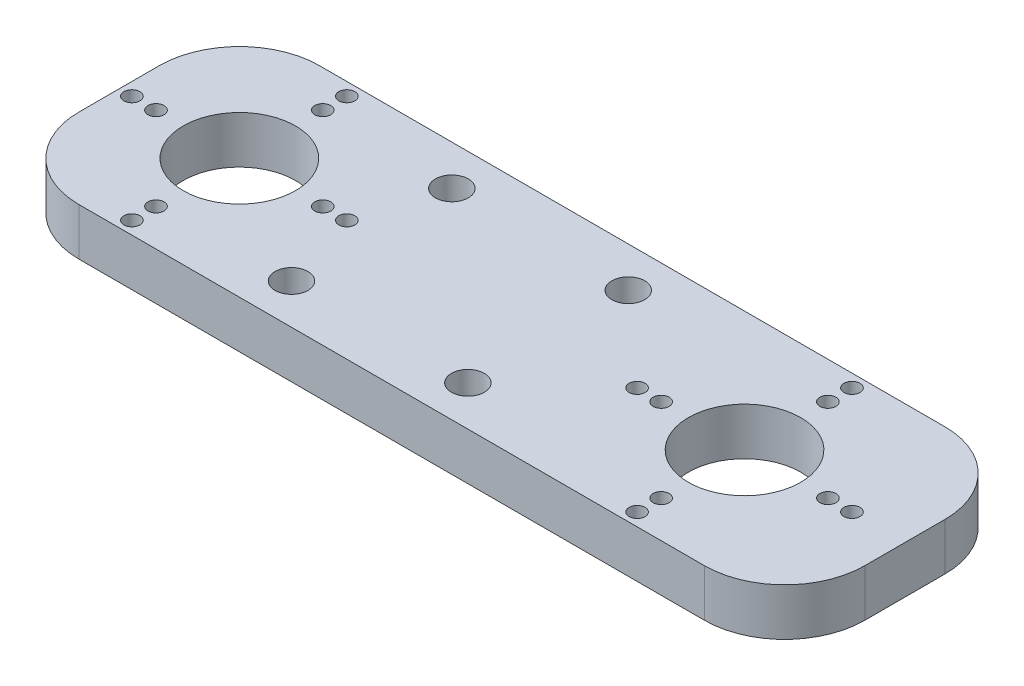
ISO-10303-21;
HEADER;
FILE_DESCRIPTION(('STEP AP214'),'2;1');
FILE_NAME('part.step','',(''),(''),'','','');
FILE_SCHEMA(('AUTOMOTIVE_DESIGN { 1 0 10303 214 1 1 1 1 }'));
ENDSEC;
DATA;
#1=APPLICATION_CONTEXT('core data for automotive mechanical design processes');
#2=APPLICATION_PROTOCOL_DEFINITION('international standard','automotive_design',2000,#1);
#3=PRODUCT_CONTEXT('',#1,'mechanical');
#4=PRODUCT('Part','Part','',(#3));
#5=PRODUCT_RELATED_PRODUCT_CATEGORY('part','',(#4));
#6=PRODUCT_DEFINITION_FORMATION('','',#4);
#7=PRODUCT_DEFINITION_CONTEXT('part definition',#1,'design');
#8=PRODUCT_DEFINITION('design','',#6,#7);
#9=PRODUCT_DEFINITION_SHAPE('','',#8);
#10=(LENGTH_UNIT() NAMED_UNIT(*) SI_UNIT(.MILLI.,.METRE.));
#11=(NAMED_UNIT(*) PLANE_ANGLE_UNIT() SI_UNIT($,.RADIAN.));
#12=(NAMED_UNIT(*) SI_UNIT($,.STERADIAN.) SOLID_ANGLE_UNIT());
#13=UNCERTAINTY_MEASURE_WITH_UNIT(LENGTH_MEASURE(1.E-05),#10,'distance_accuracy_value','');
#14=(GEOMETRIC_REPRESENTATION_CONTEXT(3) GLOBAL_UNCERTAINTY_ASSIGNED_CONTEXT((#13)) GLOBAL_UNIT_ASSIGNED_CONTEXT((#10,
#11,#12)) REPRESENTATION_CONTEXT('',''));
#15=CARTESIAN_POINT('',(0.,0.,0.));
#16=DIRECTION('',(0.,0.,1.));
#17=DIRECTION('',(1.,0.,0.));
#18=AXIS2_PLACEMENT_3D('',#15,#16,#17);
#19=CARTESIAN_POINT('',(0.,5.9,0.));
#20=DIRECTION('',(0.,-1.,0.));
#21=DIRECTION('',(0.,0.,-1.));
#22=AXIS2_PLACEMENT_3D('',#19,#20,#21);
#23=PLANE('',#22);
#24=CARTESIAN_POINT('',(-17.5,5.9,-10.));
#25=DIRECTION('',(0.,1.,0.));
#26=DIRECTION('',(0.,0.,1.));
#27=AXIS2_PLACEMENT_3D('',#24,#25,#26);
#28=CIRCLE('',#27,2.05);
#29=CARTESIAN_POINT('',(-17.5,5.9,-7.95));
#30=VERTEX_POINT('',#29);
#31=EDGE_CURVE('E680',#30,#30,#28,.T.);
#32=ORIENTED_EDGE('',*,*,#31,.F.);
#33=EDGE_LOOP('',(#32));
#34=FACE_BOUND('',#33,.T.);
#35=CARTESIAN_POINT('',(4.49999999999999,5.9,10.));
#36=DIRECTION('',(0.,1.,0.));
#37=DIRECTION('',(0.,0.,-1.));
#38=AXIS2_PLACEMENT_3D('',#35,#36,#37);
#39=CIRCLE('',#38,2.05);
#40=CARTESIAN_POINT('',(4.49999999999999,5.9,7.95));
#41=VERTEX_POINT('',#40);
#42=EDGE_CURVE('E681',#41,#41,#39,.T.);
#43=ORIENTED_EDGE('',*,*,#42,.F.);
#44=EDGE_LOOP('',(#43));
#45=FACE_BOUND('',#44,.T.);
#46=CARTESIAN_POINT('',(4.5,5.9,-10.));
#47=DIRECTION('',(0.,1.,0.));
#48=DIRECTION('',(0.,0.,-1.));
#49=AXIS2_PLACEMENT_3D('',#46,#47,#48);
#50=CIRCLE('',#49,2.05);
#51=CARTESIAN_POINT('',(4.5,5.9,-12.05));
#52=VERTEX_POINT('',#51);
#53=EDGE_CURVE('E685',#52,#52,#50,.T.);
#54=ORIENTED_EDGE('',*,*,#53,.F.);
#55=EDGE_LOOP('',(#54));
#56=FACE_BOUND('',#55,.T.);
#57=CARTESIAN_POINT('',(-17.5,5.9,10.));
#58=DIRECTION('',(0.,1.,0.));
#59=DIRECTION('',(0.,0.,1.));
#60=AXIS2_PLACEMENT_3D('',#57,#58,#59);
#61=CIRCLE('',#60,2.05);
#62=CARTESIAN_POINT('',(-17.5,5.9,12.05));
#63=VERTEX_POINT('',#62);
#64=EDGE_CURVE('E201',#63,#63,#61,.T.);
#65=ORIENTED_EDGE('',*,*,#64,.F.);
#66=EDGE_LOOP('',(#65));
#67=FACE_BOUND('',#66,.T.);
#68=CARTESIAN_POINT('',(29.,5.9,10.4));
#69=DIRECTION('',(0.,1.,0.));
#70=DIRECTION('',(0.,0.,-1.));
#71=AXIS2_PLACEMENT_3D('',#68,#69,#70);
#72=CIRCLE('',#71,0.999999999999991);
#73=CARTESIAN_POINT('',(29.,5.9,9.40000000000002));
#74=VERTEX_POINT('',#73);
#75=EDGE_CURVE('E231',#74,#74,#72,.T.);
#76=ORIENTED_EDGE('',*,*,#75,.F.);
#77=EDGE_LOOP('',(#76));
#78=FACE_BOUND('',#77,.T.);
#79=CARTESIAN_POINT('',(42.4,5.9,0.));
#80=DIRECTION('',(0.,1.,0.));
#81=DIRECTION('',(0.,0.,-1.));
#82=AXIS2_PLACEMENT_3D('',#79,#80,#81);
#83=CIRCLE('',#82,0.999999999999998);
#84=CARTESIAN_POINT('',(42.4,5.9,-1.00000000000001));
#85=VERTEX_POINT('',#84);
#86=EDGE_CURVE('E234',#85,#85,#83,.T.);
#87=ORIENTED_EDGE('',*,*,#86,.F.);
#88=EDGE_LOOP('',(#87));
#89=FACE_BOUND('',#88,.T.);
#90=CARTESIAN_POINT('',(39.4,5.9,0.));
#91=DIRECTION('',(0.,1.,0.));
#92=DIRECTION('',(0.,0.,-1.));
#93=AXIS2_PLACEMENT_3D('',#90,#91,#92);
#94=CIRCLE('',#93,0.999999999999998);
#95=CARTESIAN_POINT('',(39.4,5.9,-1.00000000000001));
#96=VERTEX_POINT('',#95);
#97=EDGE_CURVE('E228',#96,#96,#94,.T.);
#98=ORIENTED_EDGE('',*,*,#97,.F.);
#99=EDGE_LOOP('',(#98));
#100=FACE_BOUND('',#99,.T.);
#101=CARTESIAN_POINT('',(18.6,5.9,0.));
#102=DIRECTION('',(0.,1.,0.));
#103=DIRECTION('',(0.,0.,-1.));
#104=AXIS2_PLACEMENT_3D('',#101,#102,#103);
#105=CIRCLE('',#104,0.999999999999998);
#106=CARTESIAN_POINT('',(18.6,5.9,-0.999999999999997));
#107=VERTEX_POINT('',#106);
#108=EDGE_CURVE('E212',#107,#107,#105,.T.);
#109=ORIENTED_EDGE('',*,*,#108,.F.);
#110=EDGE_LOOP('',(#109));
#111=FACE_BOUND('',#110,.T.);
#112=CARTESIAN_POINT('',(29.,5.9,-13.4));
#113=DIRECTION('',(0.,1.,0.));
#114=DIRECTION('',(0.,0.,-1.));
#115=AXIS2_PLACEMENT_3D('',#112,#113,#114);
#116=CIRCLE('',#115,0.999999999999998);
#117=CARTESIAN_POINT('',(29.,5.9,-14.4));
#118=VERTEX_POINT('',#117);
#119=EDGE_CURVE('E217',#118,#118,#116,.T.);
#120=ORIENTED_EDGE('',*,*,#119,.F.);
#121=EDGE_LOOP('',(#120));
#122=FACE_BOUND('',#121,.T.);
#123=CARTESIAN_POINT('',(29.,5.9,-10.4));
#124=DIRECTION('',(0.,1.,0.));
#125=DIRECTION('',(0.,0.,-1.));
#126=AXIS2_PLACEMENT_3D('',#123,#124,#125);
#127=CIRCLE('',#126,0.999999999999998);
#128=CARTESIAN_POINT('',(29.,5.9,-11.4));
#129=VERTEX_POINT('',#128);
#130=EDGE_CURVE('E223',#129,#129,#127,.T.);
#131=ORIENTED_EDGE('',*,*,#130,.F.);
#132=EDGE_LOOP('',(#131));
#133=FACE_BOUND('',#132,.T.);
#134=CARTESIAN_POINT('',(29.,5.9,0.));
#135=DIRECTION('',(0.,1.,0.));
#136=DIRECTION('',(0.,0.,-1.));
#137=AXIS2_PLACEMENT_3D('',#134,#135,#136);
#138=CIRCLE('',#137,7.);
#139=CARTESIAN_POINT('',(29.,5.9,-7.));
#140=VERTEX_POINT('',#139);
#141=EDGE_CURVE('E225',#140,#140,#138,.T.);
#142=ORIENTED_EDGE('',*,*,#141,.F.);
#143=EDGE_LOOP('',(#142));
#144=FACE_BOUND('',#143,.T.);
#145=CARTESIAN_POINT('',(29.,5.9,13.4));
#146=DIRECTION('',(0.,1.,0.));
#147=DIRECTION('',(0.,0.,-1.));
#148=AXIS2_PLACEMENT_3D('',#145,#146,#147);
#149=CIRCLE('',#148,0.999999999999991);
#150=CARTESIAN_POINT('',(29.,5.9,12.4));
#151=VERTEX_POINT('',#150);
#152=EDGE_CURVE('E150',#151,#151,#149,.T.);
#153=ORIENTED_EDGE('',*,*,#152,.F.);
#154=EDGE_LOOP('',(#153));
#155=FACE_BOUND('',#154,.T.);
#156=CARTESIAN_POINT('',(15.6,5.9,0.));
#157=DIRECTION('',(0.,1.,0.));
#158=DIRECTION('',(0.,0.,-1.));
#159=AXIS2_PLACEMENT_3D('',#156,#157,#158);
#160=CIRCLE('',#159,0.999999999999998);
#161=CARTESIAN_POINT('',(15.6,5.9,-0.999999999999996));
#162=VERTEX_POINT('',#161);
#163=EDGE_CURVE('E208',#162,#162,#160,.T.);
#164=ORIENTED_EDGE('',*,*,#163,.F.);
#165=EDGE_LOOP('',(#164));
#166=FACE_BOUND('',#165,.T.);
#167=DIRECTION('',(1.,0.,0.));
#168=VECTOR('',#167,1.);
#169=CARTESIAN_POINT('',(-49.,5.9,15.));
#170=LINE('',#169,#168);
#171=CARTESIAN_POINT('',(-39.,5.9,15.));
#172=VERTEX_POINT('',#171);
#173=CARTESIAN_POINT('',(39.,5.9,15.));
#174=VERTEX_POINT('',#173);
#175=EDGE_CURVE('E140',#172,#174,#170,.T.);
#176=ORIENTED_EDGE('',*,*,#175,.T.);
#177=CARTESIAN_POINT('',(39.,5.9,5.));
#178=DIRECTION('',(0.,-1.,0.));
#179=DIRECTION('',(0.,0.,-1.));
#180=AXIS2_PLACEMENT_3D('',#177,#178,#179);
#181=CIRCLE('',#180,10.);
#182=CARTESIAN_POINT('',(49.,5.9,5.));
#183=VERTEX_POINT('',#182);
#184=EDGE_CURVE('E188',#174,#183,#181,.F.);
#185=ORIENTED_EDGE('',*,*,#184,.T.);
#186=DIRECTION('',(0.,0.,-1.));
#187=VECTOR('',#186,1.);
#188=CARTESIAN_POINT('',(49.,5.9,15.));
#189=LINE('',#188,#187);
#190=CARTESIAN_POINT('',(49.,5.9,-5.));
#191=VERTEX_POINT('',#190);
#192=EDGE_CURVE('E123',#183,#191,#189,.T.);
#193=ORIENTED_EDGE('',*,*,#192,.T.);
#194=CARTESIAN_POINT('',(39.,5.9,-5.));
#195=DIRECTION('',(0.,-1.,0.));
#196=DIRECTION('',(0.,0.,-1.));
#197=AXIS2_PLACEMENT_3D('',#194,#195,#196);
#198=CIRCLE('',#197,10.);
#199=CARTESIAN_POINT('',(39.,5.9,-15.));
#200=VERTEX_POINT('',#199);
#201=EDGE_CURVE('E186',#191,#200,#198,.F.);
#202=ORIENTED_EDGE('',*,*,#201,.T.);
#203=DIRECTION('',(-1.,0.,0.));
#204=VECTOR('',#203,1.);
#205=CARTESIAN_POINT('',(-49.,5.9,-15.));
#206=LINE('',#205,#204);
#207=CARTESIAN_POINT('',(-39.,5.9,-15.));
#208=VERTEX_POINT('',#207);
#209=EDGE_CURVE('E291',#200,#208,#206,.T.);
#210=ORIENTED_EDGE('',*,*,#209,.T.);
#211=CARTESIAN_POINT('',(-39.,5.9,-5.));
#212=DIRECTION('',(0.,-1.,0.));
#213=DIRECTION('',(0.,0.,-1.));
#214=AXIS2_PLACEMENT_3D('',#211,#212,#213);
#215=CIRCLE('',#214,10.);
#216=CARTESIAN_POINT('',(-49.,5.9,-5.));
#217=VERTEX_POINT('',#216);
#218=EDGE_CURVE('E58',#208,#217,#215,.F.);
#219=ORIENTED_EDGE('',*,*,#218,.T.);
#220=DIRECTION('',(0.,0.,1.));
#221=VECTOR('',#220,1.);
#222=CARTESIAN_POINT('',(-49.,5.9,15.));
#223=LINE('',#222,#221);
#224=CARTESIAN_POINT('',(-49.,5.9,5.));
#225=VERTEX_POINT('',#224);
#226=EDGE_CURVE('E292',#217,#225,#223,.T.);
#227=ORIENTED_EDGE('',*,*,#226,.T.);
#228=CARTESIAN_POINT('',(-39.,5.9,5.));
#229=DIRECTION('',(0.,-1.,0.));
#230=DIRECTION('',(0.,0.,-1.));
#231=AXIS2_PLACEMENT_3D('',#228,#229,#230);
#232=CIRCLE('',#231,10.);
#233=EDGE_CURVE('E184',#225,#172,#232,.F.);
#234=ORIENTED_EDGE('',*,*,#233,.T.);
#235=EDGE_LOOP('',(#176,#185,#193,#202,#210,#219,#227,#234));
#236=FACE_BOUND('',#235,.T.);
#237=CARTESIAN_POINT('',(-44.4,5.9,0.));
#238=DIRECTION('',(0.,1.,0.));
#239=DIRECTION('',(0.,0.,1.));
#240=AXIS2_PLACEMENT_3D('',#237,#238,#239);
#241=CIRCLE('',#240,0.999999999999998);
#242=CARTESIAN_POINT('',(-44.4,5.9,0.999999999999998));
#243=VERTEX_POINT('',#242);
#244=EDGE_CURVE('E131',#243,#243,#241,.T.);
#245=ORIENTED_EDGE('',*,*,#244,.F.);
#246=EDGE_LOOP('',(#245));
#247=FACE_BOUND('',#246,.T.);
#248=CARTESIAN_POINT('',(-47.4,5.9,0.));
#249=DIRECTION('',(0.,1.,0.));
#250=DIRECTION('',(0.,0.,1.));
#251=AXIS2_PLACEMENT_3D('',#248,#249,#250);
#252=CIRCLE('',#251,0.999999999999998);
#253=CARTESIAN_POINT('',(-47.4,5.9,0.999999999999998));
#254=VERTEX_POINT('',#253);
#255=EDGE_CURVE('E283',#254,#254,#252,.T.);
#256=ORIENTED_EDGE('',*,*,#255,.F.);
#257=EDGE_LOOP('',(#256));
#258=FACE_BOUND('',#257,.T.);
#259=CARTESIAN_POINT('',(-34.,5.9,-10.4));
#260=DIRECTION('',(0.,1.,0.));
#261=DIRECTION('',(0.,0.,1.));
#262=AXIS2_PLACEMENT_3D('',#259,#260,#261);
#263=CIRCLE('',#262,0.999999999999998);
#264=CARTESIAN_POINT('',(-34.,5.9,-9.40000000000001));
#265=VERTEX_POINT('',#264);
#266=EDGE_CURVE('E277',#265,#265,#263,.T.);
#267=ORIENTED_EDGE('',*,*,#266,.F.);
#268=EDGE_LOOP('',(#267));
#269=FACE_BOUND('',#268,.T.);
#270=CARTESIAN_POINT('',(-34.,5.9,0.));
#271=DIRECTION('',(0.,1.,0.));
#272=DIRECTION('',(0.,0.,1.));
#273=AXIS2_PLACEMENT_3D('',#270,#271,#272);
#274=CIRCLE('',#273,7.);
#275=CARTESIAN_POINT('',(-34.,5.9,7.));
#276=VERTEX_POINT('',#275);
#277=EDGE_CURVE('E271',#276,#276,#274,.T.);
#278=ORIENTED_EDGE('',*,*,#277,.F.);
#279=EDGE_LOOP('',(#278));
#280=FACE_BOUND('',#279,.T.);
#281=CARTESIAN_POINT('',(-34.,5.9,-13.4));
#282=DIRECTION('',(0.,1.,0.));
#283=DIRECTION('',(0.,0.,1.));
#284=AXIS2_PLACEMENT_3D('',#281,#282,#283);
#285=CIRCLE('',#284,0.999999999999998);
#286=CARTESIAN_POINT('',(-34.,5.9,-12.4));
#287=VERTEX_POINT('',#286);
#288=EDGE_CURVE('E265',#287,#287,#285,.T.);
#289=ORIENTED_EDGE('',*,*,#288,.F.);
#290=EDGE_LOOP('',(#289));
#291=FACE_BOUND('',#290,.T.);
#292=CARTESIAN_POINT('',(-23.6,5.9,0.));
#293=DIRECTION('',(0.,1.,0.));
#294=DIRECTION('',(0.,0.,1.));
#295=AXIS2_PLACEMENT_3D('',#292,#293,#294);
#296=CIRCLE('',#295,0.999999999999998);
#297=CARTESIAN_POINT('',(-23.6,5.9,1.));
#298=VERTEX_POINT('',#297);
#299=EDGE_CURVE('E259',#298,#298,#296,.T.);
#300=ORIENTED_EDGE('',*,*,#299,.F.);
#301=EDGE_LOOP('',(#300));
#302=FACE_BOUND('',#301,.T.);
#303=CARTESIAN_POINT('',(-20.6,5.9,0.));
#304=DIRECTION('',(0.,1.,0.));
#305=DIRECTION('',(0.,0.,1.));
#306=AXIS2_PLACEMENT_3D('',#303,#304,#305);
#307=CIRCLE('',#306,0.999999999999998);
#308=CARTESIAN_POINT('',(-20.6,5.9,1.));
#309=VERTEX_POINT('',#308);
#310=EDGE_CURVE('E253',#309,#309,#307,.T.);
#311=ORIENTED_EDGE('',*,*,#310,.F.);
#312=EDGE_LOOP('',(#311));
#313=FACE_BOUND('',#312,.T.);
#314=CARTESIAN_POINT('',(-34.,5.9,10.4));
#315=DIRECTION('',(0.,1.,0.));
#316=DIRECTION('',(0.,0.,1.));
#317=AXIS2_PLACEMENT_3D('',#314,#315,#316);
#318=CIRCLE('',#317,0.999999999999991);
#319=CARTESIAN_POINT('',(-34.,5.9,11.4));
#320=VERTEX_POINT('',#319);
#321=EDGE_CURVE('E247',#320,#320,#318,.T.);
#322=ORIENTED_EDGE('',*,*,#321,.F.);
#323=EDGE_LOOP('',(#322));
#324=FACE_BOUND('',#323,.T.);
#325=CARTESIAN_POINT('',(-34.,5.9,13.4));
#326=DIRECTION('',(0.,1.,0.));
#327=DIRECTION('',(0.,0.,1.));
#328=AXIS2_PLACEMENT_3D('',#325,#326,#327);
#329=CIRCLE('',#328,0.999999999999991);
#330=CARTESIAN_POINT('',(-34.,5.9,14.4));
#331=VERTEX_POINT('',#330);
#332=EDGE_CURVE('E241',#331,#331,#329,.T.);
#333=ORIENTED_EDGE('',*,*,#332,.F.);
#334=EDGE_LOOP('',(#333));
#335=FACE_BOUND('',#334,.T.);
#336=ADVANCED_FACE('F36',(#34,#45,#56,#67,#78,#89,#100,#111,#122,#133,#144,#155,#166,#236,#247,
#258,#269,#280,#291,#302,#313,#324,#335),#23,.F.);
#337=CARTESIAN_POINT('',(0.,0.,0.));
#338=DIRECTION('',(0.,-1.,0.));
#339=DIRECTION('',(0.,0.,-1.));
#340=AXIS2_PLACEMENT_3D('',#337,#338,#339);
#341=PLANE('',#340);
#342=CARTESIAN_POINT('',(-17.5,0.,-10.));
#343=DIRECTION('',(0.,-1.,0.));
#344=DIRECTION('',(0.,0.,-1.));
#345=AXIS2_PLACEMENT_3D('',#342,#343,#344);
#346=CIRCLE('',#345,2.05);
#347=CARTESIAN_POINT('',(-17.5,0.,-12.05));
#348=VERTEX_POINT('',#347);
#349=EDGE_CURVE('E40',#348,#348,#346,.T.);
#350=ORIENTED_EDGE('',*,*,#349,.F.);
#351=EDGE_LOOP('',(#350));
#352=FACE_BOUND('',#351,.T.);
#353=CARTESIAN_POINT('',(4.49999999999999,0.,10.));
#354=DIRECTION('',(0.,-1.,0.));
#355=DIRECTION('',(0.,0.,-1.));
#356=AXIS2_PLACEMENT_3D('',#353,#354,#355);
#357=CIRCLE('',#356,2.05);
#358=CARTESIAN_POINT('',(4.49999999999999,0.,7.95));
#359=VERTEX_POINT('',#358);
#360=EDGE_CURVE('E203',#359,#359,#357,.T.);
#361=ORIENTED_EDGE('',*,*,#360,.F.);
#362=EDGE_LOOP('',(#361));
#363=FACE_BOUND('',#362,.T.);
#364=CARTESIAN_POINT('',(4.5,0.,-10.));
#365=DIRECTION('',(0.,-1.,0.));
#366=DIRECTION('',(0.,0.,-1.));
#367=AXIS2_PLACEMENT_3D('',#364,#365,#366);
#368=CIRCLE('',#367,2.05);
#369=CARTESIAN_POINT('',(4.5,0.,-12.05));
#370=VERTEX_POINT('',#369);
#371=EDGE_CURVE('E200',#370,#370,#368,.T.);
#372=ORIENTED_EDGE('',*,*,#371,.F.);
#373=EDGE_LOOP('',(#372));
#374=FACE_BOUND('',#373,.T.);
#375=CARTESIAN_POINT('',(-17.5,0.,10.));
#376=DIRECTION('',(0.,-1.,0.));
#377=DIRECTION('',(0.,0.,-1.));
#378=AXIS2_PLACEMENT_3D('',#375,#376,#377);
#379=CIRCLE('',#378,2.05);
#380=CARTESIAN_POINT('',(-17.5,0.,7.95));
#381=VERTEX_POINT('',#380);
#382=EDGE_CURVE('E197',#381,#381,#379,.T.);
#383=ORIENTED_EDGE('',*,*,#382,.F.);
#384=EDGE_LOOP('',(#383));
#385=FACE_BOUND('',#384,.T.);
#386=CARTESIAN_POINT('',(29.,0.,10.4));
#387=DIRECTION('',(0.,-1.,0.));
#388=DIRECTION('',(0.,0.,-1.));
#389=AXIS2_PLACEMENT_3D('',#386,#387,#388);
#390=CIRCLE('',#389,0.999999999999991);
#391=CARTESIAN_POINT('',(29.,0.,9.40000000000002));
#392=VERTEX_POINT('',#391);
#393=EDGE_CURVE('E171',#392,#392,#390,.T.);
#394=ORIENTED_EDGE('',*,*,#393,.F.);
#395=EDGE_LOOP('',(#394));
#396=FACE_BOUND('',#395,.T.);
#397=CARTESIAN_POINT('',(42.4,0.,0.));
#398=DIRECTION('',(0.,-1.,0.));
#399=DIRECTION('',(0.,0.,-1.));
#400=AXIS2_PLACEMENT_3D('',#397,#398,#399);
#401=CIRCLE('',#400,0.999999999999998);
#402=CARTESIAN_POINT('',(42.4,0.,-1.00000000000001));
#403=VERTEX_POINT('',#402);
#404=EDGE_CURVE('E168',#403,#403,#401,.T.);
#405=ORIENTED_EDGE('',*,*,#404,.F.);
#406=EDGE_LOOP('',(#405));
#407=FACE_BOUND('',#406,.T.);
#408=CARTESIAN_POINT('',(39.4,0.,0.));
#409=DIRECTION('',(0.,-1.,0.));
#410=DIRECTION('',(0.,0.,-1.));
#411=AXIS2_PLACEMENT_3D('',#408,#409,#410);
#412=CIRCLE('',#411,0.999999999999998);
#413=CARTESIAN_POINT('',(39.4,0.,-1.00000000000001));
#414=VERTEX_POINT('',#413);
#415=EDGE_CURVE('E165',#414,#414,#412,.T.);
#416=ORIENTED_EDGE('',*,*,#415,.F.);
#417=EDGE_LOOP('',(#416));
#418=FACE_BOUND('',#417,.T.);
#419=CARTESIAN_POINT('',(18.6,0.,0.));
#420=DIRECTION('',(0.,-1.,0.));
#421=DIRECTION('',(0.,0.,-1.));
#422=AXIS2_PLACEMENT_3D('',#419,#420,#421);
#423=CIRCLE('',#422,0.999999999999998);
#424=CARTESIAN_POINT('',(18.6,0.,-0.999999999999997));
#425=VERTEX_POINT('',#424);
#426=EDGE_CURVE('E162',#425,#425,#423,.T.);
#427=ORIENTED_EDGE('',*,*,#426,.F.);
#428=EDGE_LOOP('',(#427));
#429=FACE_BOUND('',#428,.T.);
#430=CARTESIAN_POINT('',(29.,0.,-13.4));
#431=DIRECTION('',(0.,-1.,0.));
#432=DIRECTION('',(0.,0.,-1.));
#433=AXIS2_PLACEMENT_3D('',#430,#431,#432);
#434=CIRCLE('',#433,0.999999999999998);
#435=CARTESIAN_POINT('',(29.,0.,-14.4));
#436=VERTEX_POINT('',#435);
#437=EDGE_CURVE('E159',#436,#436,#434,.T.);
#438=ORIENTED_EDGE('',*,*,#437,.F.);
#439=EDGE_LOOP('',(#438));
#440=FACE_BOUND('',#439,.T.);
#441=CARTESIAN_POINT('',(29.,0.,-10.4));
#442=DIRECTION('',(0.,-1.,0.));
#443=DIRECTION('',(0.,0.,-1.));
#444=AXIS2_PLACEMENT_3D('',#441,#442,#443);
#445=CIRCLE('',#444,0.999999999999998);
#446=CARTESIAN_POINT('',(29.,0.,-11.4));
#447=VERTEX_POINT('',#446);
#448=EDGE_CURVE('E156',#447,#447,#445,.T.);
#449=ORIENTED_EDGE('',*,*,#448,.F.);
#450=EDGE_LOOP('',(#449));
#451=FACE_BOUND('',#450,.T.);
#452=CARTESIAN_POINT('',(29.,0.,0.));
#453=DIRECTION('',(0.,-1.,0.));
#454=DIRECTION('',(0.,0.,-1.));
#455=AXIS2_PLACEMENT_3D('',#452,#453,#454);
#456=CIRCLE('',#455,7.);
#457=CARTESIAN_POINT('',(29.,0.,-7.));
#458=VERTEX_POINT('',#457);
#459=EDGE_CURVE('E153',#458,#458,#456,.T.);
#460=ORIENTED_EDGE('',*,*,#459,.F.);
#461=EDGE_LOOP('',(#460));
#462=FACE_BOUND('',#461,.T.);
#463=CARTESIAN_POINT('',(29.,0.,13.4));
#464=DIRECTION('',(0.,-1.,0.));
#465=DIRECTION('',(0.,0.,-1.));
#466=AXIS2_PLACEMENT_3D('',#463,#464,#465);
#467=CIRCLE('',#466,0.999999999999991);
#468=CARTESIAN_POINT('',(29.,0.,12.4));
#469=VERTEX_POINT('',#468);
#470=EDGE_CURVE('E149',#469,#469,#467,.T.);
#471=ORIENTED_EDGE('',*,*,#470,.F.);
#472=EDGE_LOOP('',(#471));
#473=FACE_BOUND('',#472,.T.);
#474=CARTESIAN_POINT('',(15.6,0.,0.));
#475=DIRECTION('',(0.,-1.,0.));
#476=DIRECTION('',(0.,0.,-1.));
#477=AXIS2_PLACEMENT_3D('',#474,#475,#476);
#478=CIRCLE('',#477,0.999999999999998);
#479=CARTESIAN_POINT('',(15.6,0.,-0.999999999999996));
#480=VERTEX_POINT('',#479);
#481=EDGE_CURVE('E146',#480,#480,#478,.T.);
#482=ORIENTED_EDGE('',*,*,#481,.F.);
#483=EDGE_LOOP('',(#482));
#484=FACE_BOUND('',#483,.T.);
#485=CARTESIAN_POINT('',(-34.,0.,10.4));
#486=DIRECTION('',(0.,1.,0.));
#487=DIRECTION('',(0.,0.,1.));
#488=AXIS2_PLACEMENT_3D('',#485,#486,#487);
#489=CIRCLE('',#488,0.999999999999991);
#490=CARTESIAN_POINT('',(-34.,0.,11.4));
#491=VERTEX_POINT('',#490);
#492=EDGE_CURVE('E244',#491,#491,#489,.T.);
#493=ORIENTED_EDGE('',*,*,#492,.T.);
#494=EDGE_LOOP('',(#493));
#495=FACE_BOUND('',#494,.T.);
#496=CARTESIAN_POINT('',(-23.6,0.,0.));
#497=DIRECTION('',(0.,1.,0.));
#498=DIRECTION('',(0.,0.,1.));
#499=AXIS2_PLACEMENT_3D('',#496,#497,#498);
#500=CIRCLE('',#499,0.999999999999998);
#501=CARTESIAN_POINT('',(-23.6,0.,1.));
#502=VERTEX_POINT('',#501);
#503=EDGE_CURVE('E256',#502,#502,#500,.T.);
#504=ORIENTED_EDGE('',*,*,#503,.T.);
#505=EDGE_LOOP('',(#504));
#506=FACE_BOUND('',#505,.T.);
#507=CARTESIAN_POINT('',(-34.,0.,0.));
#508=DIRECTION('',(0.,1.,0.));
#509=DIRECTION('',(0.,0.,1.));
#510=AXIS2_PLACEMENT_3D('',#507,#508,#509);
#511=CIRCLE('',#510,7.);
#512=CARTESIAN_POINT('',(-34.,0.,7.));
#513=VERTEX_POINT('',#512);
#514=EDGE_CURVE('E268',#513,#513,#511,.T.);
#515=ORIENTED_EDGE('',*,*,#514,.T.);
#516=EDGE_LOOP('',(#515));
#517=FACE_BOUND('',#516,.T.);
#518=CARTESIAN_POINT('',(-47.4,0.,0.));
#519=DIRECTION('',(0.,1.,0.));
#520=DIRECTION('',(0.,0.,1.));
#521=AXIS2_PLACEMENT_3D('',#518,#519,#520);
#522=CIRCLE('',#521,0.999999999999998);
#523=CARTESIAN_POINT('',(-47.4,0.,0.999999999999998));
#524=VERTEX_POINT('',#523);
#525=EDGE_CURVE('E280',#524,#524,#522,.T.);
#526=ORIENTED_EDGE('',*,*,#525,.T.);
#527=EDGE_LOOP('',(#526));
#528=FACE_BOUND('',#527,.T.);
#529=DIRECTION('',(0.,0.,-1.));
#530=VECTOR('',#529,1.);
#531=CARTESIAN_POINT('',(49.,0.,15.));
#532=LINE('',#531,#530);
#533=CARTESIAN_POINT('',(49.,0.,5.));
#534=VERTEX_POINT('',#533);
#535=CARTESIAN_POINT('',(49.,0.,-5.));
#536=VERTEX_POINT('',#535);
#537=EDGE_CURVE('E120',#534,#536,#532,.T.);
#538=ORIENTED_EDGE('',*,*,#537,.F.);
#539=CARTESIAN_POINT('',(39.,0.,5.));
#540=DIRECTION('',(0.,-1.,0.));
#541=DIRECTION('',(0.,0.,-1.));
#542=AXIS2_PLACEMENT_3D('',#539,#540,#541);
#543=CIRCLE('',#542,10.);
#544=CARTESIAN_POINT('',(39.,0.,15.));
#545=VERTEX_POINT('',#544);
#546=EDGE_CURVE('E103',#534,#545,#543,.T.);
#547=ORIENTED_EDGE('',*,*,#546,.T.);
#548=DIRECTION('',(1.,0.,0.));
#549=VECTOR('',#548,1.);
#550=CARTESIAN_POINT('',(-49.,0.,15.));
#551=LINE('',#550,#549);
#552=CARTESIAN_POINT('',(-39.,0.,15.));
#553=VERTEX_POINT('',#552);
#554=EDGE_CURVE('E144',#553,#545,#551,.T.);
#555=ORIENTED_EDGE('',*,*,#554,.F.);
#556=CARTESIAN_POINT('',(-39.,0.,5.));
#557=DIRECTION('',(0.,-1.,0.));
#558=DIRECTION('',(0.,0.,-1.));
#559=AXIS2_PLACEMENT_3D('',#556,#557,#558);
#560=CIRCLE('',#559,10.);
#561=CARTESIAN_POINT('',(-49.,0.,5.));
#562=VERTEX_POINT('',#561);
#563=EDGE_CURVE('E177',#553,#562,#560,.T.);
#564=ORIENTED_EDGE('',*,*,#563,.T.);
#565=DIRECTION('',(0.,0.,1.));
#566=VECTOR('',#565,1.);
#567=CARTESIAN_POINT('',(-49.,0.,15.));
#568=LINE('',#567,#566);
#569=CARTESIAN_POINT('',(-49.,0.,-5.));
#570=VERTEX_POINT('',#569);
#571=EDGE_CURVE('E134',#570,#562,#568,.T.);
#572=ORIENTED_EDGE('',*,*,#571,.F.);
#573=CARTESIAN_POINT('',(-39.,0.,-5.));
#574=DIRECTION('',(0.,-1.,0.));
#575=DIRECTION('',(0.,0.,-1.));
#576=AXIS2_PLACEMENT_3D('',#573,#574,#575);
#577=CIRCLE('',#576,10.);
#578=CARTESIAN_POINT('',(-39.,0.,-15.));
#579=VERTEX_POINT('',#578);
#580=EDGE_CURVE('E124',#570,#579,#577,.T.);
#581=ORIENTED_EDGE('',*,*,#580,.T.);
#582=DIRECTION('',(-1.,0.,0.));
#583=VECTOR('',#582,1.);
#584=CARTESIAN_POINT('',(-49.,0.,-15.));
#585=LINE('',#584,#583);
#586=CARTESIAN_POINT('',(39.,0.,-15.));
#587=VERTEX_POINT('',#586);
#588=EDGE_CURVE('E130',#587,#579,#585,.T.);
#589=ORIENTED_EDGE('',*,*,#588,.F.);
#590=CARTESIAN_POINT('',(39.,0.,-5.));
#591=DIRECTION('',(0.,-1.,0.));
#592=DIRECTION('',(0.,0.,-1.));
#593=AXIS2_PLACEMENT_3D('',#590,#591,#592);
#594=CIRCLE('',#593,10.);
#595=EDGE_CURVE('E114',#587,#536,#594,.T.);
#596=ORIENTED_EDGE('',*,*,#595,.T.);
#597=EDGE_LOOP('',(#538,#547,#555,#564,#572,#581,#589,#596));
#598=FACE_BOUND('',#597,.T.);
#599=CARTESIAN_POINT('',(-44.4,0.,0.));
#600=DIRECTION('',(0.,1.,0.));
#601=DIRECTION('',(0.,0.,1.));
#602=AXIS2_PLACEMENT_3D('',#599,#600,#601);
#603=CIRCLE('',#602,0.999999999999998);
#604=CARTESIAN_POINT('',(-44.4,0.,0.999999999999998));
#605=VERTEX_POINT('',#604);
#606=EDGE_CURVE('E137',#605,#605,#603,.T.);
#607=ORIENTED_EDGE('',*,*,#606,.T.);
#608=EDGE_LOOP('',(#607));
#609=FACE_BOUND('',#608,.T.);
#610=CARTESIAN_POINT('',(-34.,0.,-10.4));
#611=DIRECTION('',(0.,1.,0.));
#612=DIRECTION('',(0.,0.,1.));
#613=AXIS2_PLACEMENT_3D('',#610,#611,#612);
#614=CIRCLE('',#613,0.999999999999998);
#615=CARTESIAN_POINT('',(-34.,0.,-9.40000000000001));
#616=VERTEX_POINT('',#615);
#617=EDGE_CURVE('E274',#616,#616,#614,.T.);
#618=ORIENTED_EDGE('',*,*,#617,.T.);
#619=EDGE_LOOP('',(#618));
#620=FACE_BOUND('',#619,.T.);
#621=CARTESIAN_POINT('',(-34.,0.,-13.4));
#622=DIRECTION('',(0.,1.,0.));
#623=DIRECTION('',(0.,0.,1.));
#624=AXIS2_PLACEMENT_3D('',#621,#622,#623);
#625=CIRCLE('',#624,0.999999999999998);
#626=CARTESIAN_POINT('',(-34.,0.,-12.4));
#627=VERTEX_POINT('',#626);
#628=EDGE_CURVE('E262',#627,#627,#625,.T.);
#629=ORIENTED_EDGE('',*,*,#628,.T.);
#630=EDGE_LOOP('',(#629));
#631=FACE_BOUND('',#630,.T.);
#632=CARTESIAN_POINT('',(-20.6,0.,0.));
#633=DIRECTION('',(0.,1.,0.));
#634=DIRECTION('',(0.,0.,1.));
#635=AXIS2_PLACEMENT_3D('',#632,#633,#634);
#636=CIRCLE('',#635,0.999999999999998);
#637=CARTESIAN_POINT('',(-20.6,0.,1.));
#638=VERTEX_POINT('',#637);
#639=EDGE_CURVE('E250',#638,#638,#636,.T.);
#640=ORIENTED_EDGE('',*,*,#639,.T.);
#641=EDGE_LOOP('',(#640));
#642=FACE_BOUND('',#641,.T.);
#643=CARTESIAN_POINT('',(-34.,0.,13.4));
#644=DIRECTION('',(0.,1.,0.));
#645=DIRECTION('',(0.,0.,1.));
#646=AXIS2_PLACEMENT_3D('',#643,#644,#645);
#647=CIRCLE('',#646,0.999999999999991);
#648=CARTESIAN_POINT('',(-34.,0.,14.4));
#649=VERTEX_POINT('',#648);
#650=EDGE_CURVE('E174',#649,#649,#647,.T.);
#651=ORIENTED_EDGE('',*,*,#650,.T.);
#652=EDGE_LOOP('',(#651));
#653=FACE_BOUND('',#652,.T.);
#654=ADVANCED_FACE('F127',(#352,#363,#374,#385,#396,#407,#418,#429,#440,#451,#462,#473,#484,
#495,#506,#517,#528,#598,#609,#620,#631,#642,#653),#341,.T.);
#655=CARTESIAN_POINT('',(49.,5.9,15.));
#656=DIRECTION('',(-1.,0.,0.));
#657=DIRECTION('',(0.,0.,1.));
#658=AXIS2_PLACEMENT_3D('',#655,#656,#657);
#659=PLANE('',#658);
#660=ORIENTED_EDGE('',*,*,#192,.F.);
#661=DIRECTION('',(0.,-1.,0.));
#662=VECTOR('',#661,1.);
#663=CARTESIAN_POINT('',(49.,5.9,5.));
#664=LINE('',#663,#662);
#665=EDGE_CURVE('E107',#183,#534,#664,.T.);
#666=ORIENTED_EDGE('',*,*,#665,.T.);
#667=ORIENTED_EDGE('',*,*,#537,.T.);
#668=DIRECTION('',(0.,-1.,0.));
#669=VECTOR('',#668,1.);
#670=CARTESIAN_POINT('',(49.,5.9,-5.));
#671=LINE('',#670,#669);
#672=EDGE_CURVE('E125',#536,#191,#671,.F.);
#673=ORIENTED_EDGE('',*,*,#672,.T.);
#674=EDGE_LOOP('',(#660,#666,#667,#673));
#675=FACE_BOUND('',#674,.T.);
#676=ADVANCED_FACE('F119',(#675),#659,.F.);
#677=CARTESIAN_POINT('',(-49.,5.9,-15.));
#678=DIRECTION('',(0.,0.,1.));
#679=DIRECTION('',(1.,0.,0.));
#680=AXIS2_PLACEMENT_3D('',#677,#678,#679);
#681=PLANE('',#680);
#682=ORIENTED_EDGE('',*,*,#209,.F.);
#683=DIRECTION('',(0.,-1.,0.));
#684=VECTOR('',#683,1.);
#685=CARTESIAN_POINT('',(39.,5.9,-15.));
#686=LINE('',#685,#684);
#687=EDGE_CURVE('E192',#200,#587,#686,.T.);
#688=ORIENTED_EDGE('',*,*,#687,.T.);
#689=ORIENTED_EDGE('',*,*,#588,.T.);
#690=DIRECTION('',(0.,-1.,0.));
#691=VECTOR('',#690,1.);
#692=CARTESIAN_POINT('',(-39.,5.9,-15.));
#693=LINE('',#692,#691);
#694=EDGE_CURVE('E190',#579,#208,#693,.F.);
#695=ORIENTED_EDGE('',*,*,#694,.T.);
#696=EDGE_LOOP('',(#682,#688,#689,#695));
#697=FACE_BOUND('',#696,.T.);
#698=ADVANCED_FACE('F309',(#697),#681,.F.);
#699=CARTESIAN_POINT('',(-49.,5.9,15.));
#700=DIRECTION('',(1.,0.,0.));
#701=DIRECTION('',(0.,0.,-1.));
#702=AXIS2_PLACEMENT_3D('',#699,#700,#701);
#703=PLANE('',#702);
#704=ORIENTED_EDGE('',*,*,#571,.T.);
#705=DIRECTION('',(0.,-1.,0.));
#706=VECTOR('',#705,1.);
#707=CARTESIAN_POINT('',(-49.,5.9,5.));
#708=LINE('',#707,#706);
#709=EDGE_CURVE('E11',#562,#225,#708,.F.);
#710=ORIENTED_EDGE('',*,*,#709,.T.);
#711=ORIENTED_EDGE('',*,*,#226,.F.);
#712=DIRECTION('',(0.,-1.,0.));
#713=VECTOR('',#712,1.);
#714=CARTESIAN_POINT('',(-49.,5.9,-5.));
#715=LINE('',#714,#713);
#716=EDGE_CURVE('E45',#217,#570,#715,.T.);
#717=ORIENTED_EDGE('',*,*,#716,.T.);
#718=EDGE_LOOP('',(#704,#710,#711,#717));
#719=FACE_BOUND('',#718,.T.);
#720=ADVANCED_FACE('F303',(#719),#703,.F.);
#721=CARTESIAN_POINT('',(-49.,5.9,15.));
#722=DIRECTION('',(0.,0.,-1.));
#723=DIRECTION('',(-1.,0.,0.));
#724=AXIS2_PLACEMENT_3D('',#721,#722,#723);
#725=PLANE('',#724);
#726=ORIENTED_EDGE('',*,*,#554,.T.);
#727=DIRECTION('',(0.,-1.,0.));
#728=VECTOR('',#727,1.);
#729=CARTESIAN_POINT('',(39.,5.9,15.));
#730=LINE('',#729,#728);
#731=EDGE_CURVE('E108',#545,#174,#730,.F.);
#732=ORIENTED_EDGE('',*,*,#731,.T.);
#733=ORIENTED_EDGE('',*,*,#175,.F.);
#734=DIRECTION('',(0.,-1.,0.));
#735=VECTOR('',#734,1.);
#736=CARTESIAN_POINT('',(-39.,5.9,15.));
#737=LINE('',#736,#735);
#738=EDGE_CURVE('E113',#172,#553,#737,.T.);
#739=ORIENTED_EDGE('',*,*,#738,.T.);
#740=EDGE_LOOP('',(#726,#732,#733,#739));
#741=FACE_BOUND('',#740,.T.);
#742=ADVANCED_FACE('F299',(#741),#725,.F.);
#743=CARTESIAN_POINT('',(-44.4,5.9,0.));
#744=DIRECTION('',(0.,-1.,0.));
#745=DIRECTION('',(0.,0.,-1.));
#746=AXIS2_PLACEMENT_3D('',#743,#744,#745);
#747=CYLINDRICAL_SURFACE('',#746,0.999999999999998);
#748=ORIENTED_EDGE('',*,*,#244,.T.);
#749=EDGE_LOOP('',(#748));
#750=FACE_BOUND('',#749,.T.);
#751=ORIENTED_EDGE('',*,*,#606,.F.);
#752=EDGE_LOOP('',(#751));
#753=FACE_BOUND('',#752,.T.);
#754=ADVANCED_FACE('F333',(#750,#753),#747,.F.);
#755=CARTESIAN_POINT('',(-47.4,5.9,0.));
#756=DIRECTION('',(0.,-1.,0.));
#757=DIRECTION('',(0.,0.,-1.));
#758=AXIS2_PLACEMENT_3D('',#755,#756,#757);
#759=CYLINDRICAL_SURFACE('',#758,0.999999999999998);
#760=ORIENTED_EDGE('',*,*,#255,.T.);
#761=EDGE_LOOP('',(#760));
#762=FACE_BOUND('',#761,.T.);
#763=ORIENTED_EDGE('',*,*,#525,.F.);
#764=EDGE_LOOP('',(#763));
#765=FACE_BOUND('',#764,.T.);
#766=ADVANCED_FACE('F367',(#762,#765),#759,.F.);
#767=CARTESIAN_POINT('',(-34.,5.9,-10.4));
#768=DIRECTION('',(0.,-1.,0.));
#769=DIRECTION('',(0.,0.,-1.));
#770=AXIS2_PLACEMENT_3D('',#767,#768,#769);
#771=CYLINDRICAL_SURFACE('',#770,0.999999999999998);
#772=ORIENTED_EDGE('',*,*,#266,.T.);
#773=EDGE_LOOP('',(#772));
#774=FACE_BOUND('',#773,.T.);
#775=ORIENTED_EDGE('',*,*,#617,.F.);
#776=EDGE_LOOP('',(#775));
#777=FACE_BOUND('',#776,.T.);
#778=ADVANCED_FACE('F374',(#774,#777),#771,.F.);
#779=CARTESIAN_POINT('',(-34.,5.9,0.));
#780=DIRECTION('',(0.,-1.,0.));
#781=DIRECTION('',(0.,0.,-1.));
#782=AXIS2_PLACEMENT_3D('',#779,#780,#781);
#783=CYLINDRICAL_SURFACE('',#782,7.);
#784=ORIENTED_EDGE('',*,*,#277,.T.);
#785=EDGE_LOOP('',(#784));
#786=FACE_BOUND('',#785,.T.);
#787=ORIENTED_EDGE('',*,*,#514,.F.);
#788=EDGE_LOOP('',(#787));
#789=FACE_BOUND('',#788,.T.);
#790=ADVANCED_FACE('F381',(#786,#789),#783,.F.);
#791=CARTESIAN_POINT('',(-34.,5.9,-13.4));
#792=DIRECTION('',(0.,-1.,0.));
#793=DIRECTION('',(0.,0.,-1.));
#794=AXIS2_PLACEMENT_3D('',#791,#792,#793);
#795=CYLINDRICAL_SURFACE('',#794,0.999999999999998);
#796=ORIENTED_EDGE('',*,*,#288,.T.);
#797=EDGE_LOOP('',(#796));
#798=FACE_BOUND('',#797,.T.);
#799=ORIENTED_EDGE('',*,*,#628,.F.);
#800=EDGE_LOOP('',(#799));
#801=FACE_BOUND('',#800,.T.);
#802=ADVANCED_FACE('F389',(#798,#801),#795,.F.);
#803=CARTESIAN_POINT('',(-23.6,5.9,0.));
#804=DIRECTION('',(0.,-1.,0.));
#805=DIRECTION('',(0.,0.,-1.));
#806=AXIS2_PLACEMENT_3D('',#803,#804,#805);
#807=CYLINDRICAL_SURFACE('',#806,0.999999999999998);
#808=ORIENTED_EDGE('',*,*,#299,.T.);
#809=EDGE_LOOP('',(#808));
#810=FACE_BOUND('',#809,.T.);
#811=ORIENTED_EDGE('',*,*,#503,.F.);
#812=EDGE_LOOP('',(#811));
#813=FACE_BOUND('',#812,.T.);
#814=ADVANCED_FACE('F397',(#810,#813),#807,.F.);
#815=CARTESIAN_POINT('',(-20.6,5.9,0.));
#816=DIRECTION('',(0.,-1.,0.));
#817=DIRECTION('',(0.,0.,-1.));
#818=AXIS2_PLACEMENT_3D('',#815,#816,#817);
#819=CYLINDRICAL_SURFACE('',#818,0.999999999999998);
#820=ORIENTED_EDGE('',*,*,#310,.T.);
#821=EDGE_LOOP('',(#820));
#822=FACE_BOUND('',#821,.T.);
#823=ORIENTED_EDGE('',*,*,#639,.F.);
#824=EDGE_LOOP('',(#823));
#825=FACE_BOUND('',#824,.T.);
#826=ADVANCED_FACE('F405',(#822,#825),#819,.F.);
#827=CARTESIAN_POINT('',(-34.,5.9,10.4));
#828=DIRECTION('',(0.,-1.,0.));
#829=DIRECTION('',(0.,0.,-1.));
#830=AXIS2_PLACEMENT_3D('',#827,#828,#829);
#831=CYLINDRICAL_SURFACE('',#830,0.999999999999991);
#832=ORIENTED_EDGE('',*,*,#321,.T.);
#833=EDGE_LOOP('',(#832));
#834=FACE_BOUND('',#833,.T.);
#835=ORIENTED_EDGE('',*,*,#492,.F.);
#836=EDGE_LOOP('',(#835));
#837=FACE_BOUND('',#836,.T.);
#838=ADVANCED_FACE('F413',(#834,#837),#831,.F.);
#839=CARTESIAN_POINT('',(-34.,5.9,13.4));
#840=DIRECTION('',(0.,-1.,0.));
#841=DIRECTION('',(0.,0.,-1.));
#842=AXIS2_PLACEMENT_3D('',#839,#840,#841);
#843=CYLINDRICAL_SURFACE('',#842,0.999999999999991);
#844=ORIENTED_EDGE('',*,*,#332,.T.);
#845=EDGE_LOOP('',(#844));
#846=FACE_BOUND('',#845,.T.);
#847=ORIENTED_EDGE('',*,*,#650,.F.);
#848=EDGE_LOOP('',(#847));
#849=FACE_BOUND('',#848,.T.);
#850=ADVANCED_FACE('F421',(#846,#849),#843,.F.);
#851=CARTESIAN_POINT('',(15.6,-4.1,0.));
#852=DIRECTION('',(0.,1.,0.));
#853=DIRECTION('',(0.,0.,1.));
#854=AXIS2_PLACEMENT_3D('',#851,#852,#853);
#855=CYLINDRICAL_SURFACE('',#854,0.999999999999998);
#856=ORIENTED_EDGE('',*,*,#481,.T.);
#857=EDGE_LOOP('',(#856));
#858=FACE_BOUND('',#857,.T.);
#859=ORIENTED_EDGE('',*,*,#163,.T.);
#860=EDGE_LOOP('',(#859));
#861=FACE_BOUND('',#860,.T.);
#862=ADVANCED_FACE('F429',(#858,#861),#855,.F.);
#863=CARTESIAN_POINT('',(29.,-4.1,13.4));
#864=DIRECTION('',(0.,1.,0.));
#865=DIRECTION('',(0.,0.,1.));
#866=AXIS2_PLACEMENT_3D('',#863,#864,#865);
#867=CYLINDRICAL_SURFACE('',#866,0.999999999999991);
#868=ORIENTED_EDGE('',*,*,#470,.T.);
#869=EDGE_LOOP('',(#868));
#870=FACE_BOUND('',#869,.T.);
#871=ORIENTED_EDGE('',*,*,#152,.T.);
#872=EDGE_LOOP('',(#871));
#873=FACE_BOUND('',#872,.T.);
#874=ADVANCED_FACE('F437',(#870,#873),#867,.F.);
#875=CARTESIAN_POINT('',(29.,-4.1,0.));
#876=DIRECTION('',(0.,1.,0.));
#877=DIRECTION('',(0.,0.,1.));
#878=AXIS2_PLACEMENT_3D('',#875,#876,#877);
#879=CYLINDRICAL_SURFACE('',#878,7.);
#880=ORIENTED_EDGE('',*,*,#459,.T.);
#881=EDGE_LOOP('',(#880));
#882=FACE_BOUND('',#881,.T.);
#883=ORIENTED_EDGE('',*,*,#141,.T.);
#884=EDGE_LOOP('',(#883));
#885=FACE_BOUND('',#884,.T.);
#886=ADVANCED_FACE('F445',(#882,#885),#879,.F.);
#887=CARTESIAN_POINT('',(29.,-4.1,-10.4));
#888=DIRECTION('',(0.,1.,0.));
#889=DIRECTION('',(0.,0.,1.));
#890=AXIS2_PLACEMENT_3D('',#887,#888,#889);
#891=CYLINDRICAL_SURFACE('',#890,0.999999999999998);
#892=ORIENTED_EDGE('',*,*,#448,.T.);
#893=EDGE_LOOP('',(#892));
#894=FACE_BOUND('',#893,.T.);
#895=ORIENTED_EDGE('',*,*,#130,.T.);
#896=EDGE_LOOP('',(#895));
#897=FACE_BOUND('',#896,.T.);
#898=ADVANCED_FACE('F453',(#894,#897),#891,.F.);
#899=CARTESIAN_POINT('',(29.,-4.1,-13.4));
#900=DIRECTION('',(0.,1.,0.));
#901=DIRECTION('',(0.,0.,1.));
#902=AXIS2_PLACEMENT_3D('',#899,#900,#901);
#903=CYLINDRICAL_SURFACE('',#902,0.999999999999998);
#904=ORIENTED_EDGE('',*,*,#437,.T.);
#905=EDGE_LOOP('',(#904));
#906=FACE_BOUND('',#905,.T.);
#907=ORIENTED_EDGE('',*,*,#119,.T.);
#908=EDGE_LOOP('',(#907));
#909=FACE_BOUND('',#908,.T.);
#910=ADVANCED_FACE('F461',(#906,#909),#903,.F.);
#911=CARTESIAN_POINT('',(18.6,-4.1,0.));
#912=DIRECTION('',(0.,1.,0.));
#913=DIRECTION('',(0.,0.,1.));
#914=AXIS2_PLACEMENT_3D('',#911,#912,#913);
#915=CYLINDRICAL_SURFACE('',#914,0.999999999999998);
#916=ORIENTED_EDGE('',*,*,#426,.T.);
#917=EDGE_LOOP('',(#916));
#918=FACE_BOUND('',#917,.T.);
#919=ORIENTED_EDGE('',*,*,#108,.T.);
#920=EDGE_LOOP('',(#919));
#921=FACE_BOUND('',#920,.T.);
#922=ADVANCED_FACE('F469',(#918,#921),#915,.F.);
#923=CARTESIAN_POINT('',(39.4,-4.1,0.));
#924=DIRECTION('',(0.,1.,0.));
#925=DIRECTION('',(0.,0.,1.));
#926=AXIS2_PLACEMENT_3D('',#923,#924,#925);
#927=CYLINDRICAL_SURFACE('',#926,0.999999999999998);
#928=ORIENTED_EDGE('',*,*,#415,.T.);
#929=EDGE_LOOP('',(#928));
#930=FACE_BOUND('',#929,.T.);
#931=ORIENTED_EDGE('',*,*,#97,.T.);
#932=EDGE_LOOP('',(#931));
#933=FACE_BOUND('',#932,.T.);
#934=ADVANCED_FACE('F477',(#930,#933),#927,.F.);
#935=CARTESIAN_POINT('',(42.4,-4.1,0.));
#936=DIRECTION('',(0.,1.,0.));
#937=DIRECTION('',(0.,0.,1.));
#938=AXIS2_PLACEMENT_3D('',#935,#936,#937);
#939=CYLINDRICAL_SURFACE('',#938,0.999999999999998);
#940=ORIENTED_EDGE('',*,*,#404,.T.);
#941=EDGE_LOOP('',(#940));
#942=FACE_BOUND('',#941,.T.);
#943=ORIENTED_EDGE('',*,*,#86,.T.);
#944=EDGE_LOOP('',(#943));
#945=FACE_BOUND('',#944,.T.);
#946=ADVANCED_FACE('F485',(#942,#945),#939,.F.);
#947=CARTESIAN_POINT('',(29.,-4.1,10.4));
#948=DIRECTION('',(0.,1.,0.));
#949=DIRECTION('',(0.,0.,1.));
#950=AXIS2_PLACEMENT_3D('',#947,#948,#949);
#951=CYLINDRICAL_SURFACE('',#950,0.999999999999991);
#952=ORIENTED_EDGE('',*,*,#393,.T.);
#953=EDGE_LOOP('',(#952));
#954=FACE_BOUND('',#953,.T.);
#955=ORIENTED_EDGE('',*,*,#75,.T.);
#956=EDGE_LOOP('',(#955));
#957=FACE_BOUND('',#956,.T.);
#958=ADVANCED_FACE('F320',(#954,#957),#951,.F.);
#959=CARTESIAN_POINT('',(39.,5.9,5.));
#960=DIRECTION('',(0.,-1.,0.));
#961=DIRECTION('',(0.,0.,-1.));
#962=AXIS2_PLACEMENT_3D('',#959,#960,#961);
#963=CYLINDRICAL_SURFACE('',#962,10.);
#964=ORIENTED_EDGE('',*,*,#184,.F.);
#965=ORIENTED_EDGE('',*,*,#731,.F.);
#966=ORIENTED_EDGE('',*,*,#546,.F.);
#967=ORIENTED_EDGE('',*,*,#665,.F.);
#968=EDGE_LOOP('',(#964,#965,#966,#967));
#969=FACE_BOUND('',#968,.T.);
#970=ADVANCED_FACE('F106',(#969),#963,.T.);
#971=CARTESIAN_POINT('',(39.,5.9,-5.));
#972=DIRECTION('',(0.,-1.,0.));
#973=DIRECTION('',(0.,0.,-1.));
#974=AXIS2_PLACEMENT_3D('',#971,#972,#973);
#975=CYLINDRICAL_SURFACE('',#974,10.);
#976=ORIENTED_EDGE('',*,*,#201,.F.);
#977=ORIENTED_EDGE('',*,*,#672,.F.);
#978=ORIENTED_EDGE('',*,*,#595,.F.);
#979=ORIENTED_EDGE('',*,*,#687,.F.);
#980=EDGE_LOOP('',(#976,#977,#978,#979));
#981=FACE_BOUND('',#980,.T.);
#982=ADVANCED_FACE('F313',(#981),#975,.T.);
#983=CARTESIAN_POINT('',(-39.,5.9,5.));
#984=DIRECTION('',(0.,-1.,0.));
#985=DIRECTION('',(0.,0.,-1.));
#986=AXIS2_PLACEMENT_3D('',#983,#984,#985);
#987=CYLINDRICAL_SURFACE('',#986,10.);
#988=ORIENTED_EDGE('',*,*,#233,.F.);
#989=ORIENTED_EDGE('',*,*,#709,.F.);
#990=ORIENTED_EDGE('',*,*,#563,.F.);
#991=ORIENTED_EDGE('',*,*,#738,.F.);
#992=EDGE_LOOP('',(#988,#989,#990,#991));
#993=FACE_BOUND('',#992,.T.);
#994=ADVANCED_FACE('F301',(#993),#987,.T.);
#995=CARTESIAN_POINT('',(-39.,5.9,-5.));
#996=DIRECTION('',(0.,-1.,0.));
#997=DIRECTION('',(0.,0.,-1.));
#998=AXIS2_PLACEMENT_3D('',#995,#996,#997);
#999=CYLINDRICAL_SURFACE('',#998,10.);
#1000=ORIENTED_EDGE('',*,*,#218,.F.);
#1001=ORIENTED_EDGE('',*,*,#694,.F.);
#1002=ORIENTED_EDGE('',*,*,#580,.F.);
#1003=ORIENTED_EDGE('',*,*,#716,.F.);
#1004=EDGE_LOOP('',(#1000,#1001,#1002,#1003));
#1005=FACE_BOUND('',#1004,.T.);
#1006=ADVANCED_FACE('F38',(#1005),#999,.T.);
#1007=CARTESIAN_POINT('',(-17.5,-4.1,10.));
#1008=DIRECTION('',(0.,1.,0.));
#1009=DIRECTION('',(0.,0.,1.));
#1010=AXIS2_PLACEMENT_3D('',#1007,#1008,#1009);
#1011=CYLINDRICAL_SURFACE('',#1010,2.05);
#1012=ORIENTED_EDGE('',*,*,#382,.T.);
#1013=EDGE_LOOP('',(#1012));
#1014=FACE_BOUND('',#1013,.T.);
#1015=ORIENTED_EDGE('',*,*,#64,.T.);
#1016=EDGE_LOOP('',(#1015));
#1017=FACE_BOUND('',#1016,.T.);
#1018=ADVANCED_FACE('F524',(#1014,#1017),#1011,.F.);
#1019=CARTESIAN_POINT('',(4.5,-4.1,-10.));
#1020=DIRECTION('',(0.,1.,0.));
#1021=DIRECTION('',(0.,0.,1.));
#1022=AXIS2_PLACEMENT_3D('',#1019,#1020,#1021);
#1023=CYLINDRICAL_SURFACE('',#1022,2.05);
#1024=ORIENTED_EDGE('',*,*,#371,.T.);
#1025=EDGE_LOOP('',(#1024));
#1026=FACE_BOUND('',#1025,.T.);
#1027=ORIENTED_EDGE('',*,*,#53,.T.);
#1028=EDGE_LOOP('',(#1027));
#1029=FACE_BOUND('',#1028,.T.);
#1030=ADVANCED_FACE('F544',(#1026,#1029),#1023,.F.);
#1031=CARTESIAN_POINT('',(4.49999999999999,-4.1,10.));
#1032=DIRECTION('',(0.,1.,0.));
#1033=DIRECTION('',(0.,0.,1.));
#1034=AXIS2_PLACEMENT_3D('',#1031,#1032,#1033);
#1035=CYLINDRICAL_SURFACE('',#1034,2.05);
#1036=ORIENTED_EDGE('',*,*,#360,.T.);
#1037=EDGE_LOOP('',(#1036));
#1038=FACE_BOUND('',#1037,.T.);
#1039=ORIENTED_EDGE('',*,*,#42,.T.);
#1040=EDGE_LOOP('',(#1039));
#1041=FACE_BOUND('',#1040,.T.);
#1042=ADVANCED_FACE('F555',(#1038,#1041),#1035,.F.);
#1043=CARTESIAN_POINT('',(-17.5,-4.1,-10.));
#1044=DIRECTION('',(0.,1.,0.));
#1045=DIRECTION('',(0.,0.,1.));
#1046=AXIS2_PLACEMENT_3D('',#1043,#1044,#1045);
#1047=CYLINDRICAL_SURFACE('',#1046,2.05);
#1048=ORIENTED_EDGE('',*,*,#349,.T.);
#1049=EDGE_LOOP('',(#1048));
#1050=FACE_BOUND('',#1049,.T.);
#1051=ORIENTED_EDGE('',*,*,#31,.T.);
#1052=EDGE_LOOP('',(#1051));
#1053=FACE_BOUND('',#1052,.T.);
#1054=ADVANCED_FACE('F566',(#1050,#1053),#1047,.F.);
#1055=CLOSED_SHELL('',(#336,#654,#676,#698,#720,#742,#754,#766,#778,#790,#802,#814,#826,#838,
#850,#862,#874,#886,#898,#910,#922,#934,#946,#958,#970,#982,#994,#1006,#1018,#1030,#1042,#1054));
#1056=MANIFOLD_SOLID_BREP('B2',#1055);
#1057=ADVANCED_BREP_SHAPE_REPRESENTATION('',(#18,#1056),#14);
#1058=SHAPE_DEFINITION_REPRESENTATION(#9,#1057);
ENDSEC;
END-ISO-10303-21;
